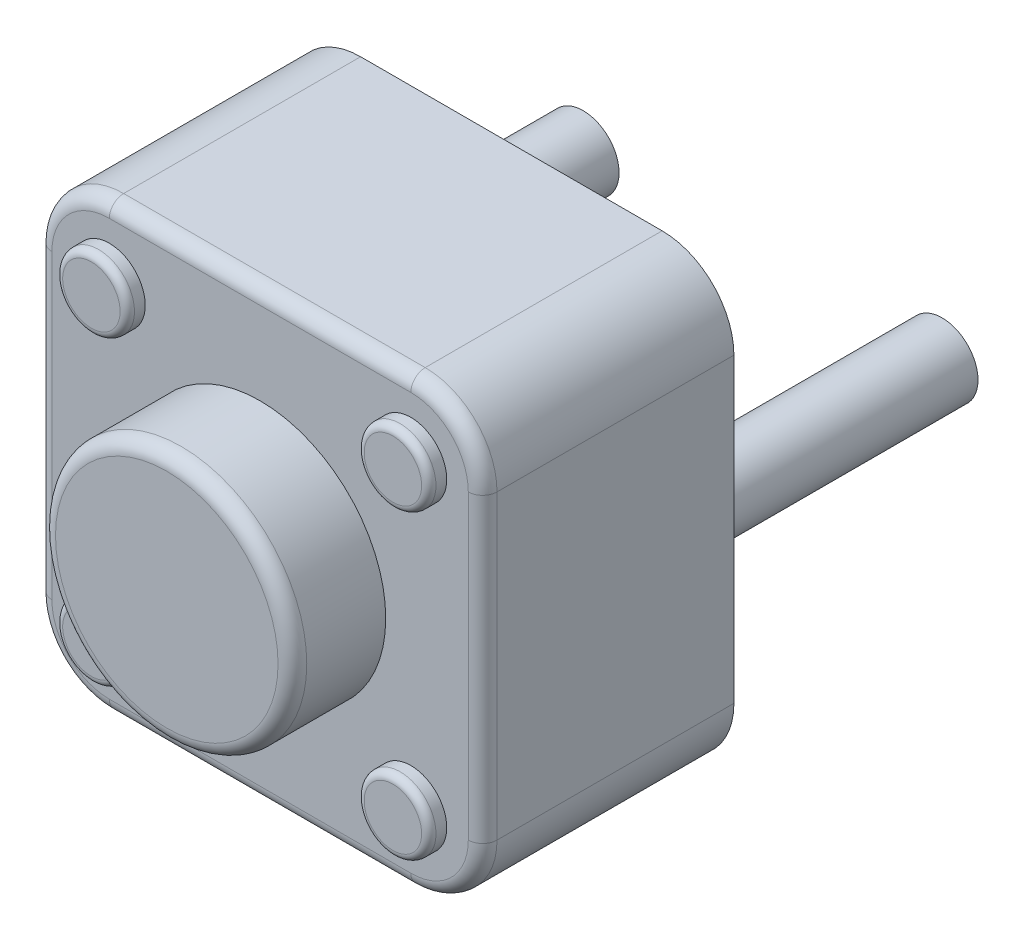
ISO-10303-21;
HEADER;
FILE_DESCRIPTION(('STEP AP214'),'2;1');
FILE_NAME('part.step','',(''),(''),'','','');
FILE_SCHEMA(('AUTOMOTIVE_DESIGN { 1 0 10303 214 1 1 1 1 }'));
ENDSEC;
DATA;
#1=APPLICATION_CONTEXT('core data for automotive mechanical design processes');
#2=APPLICATION_PROTOCOL_DEFINITION('international standard','automotive_design',2000,#1);
#3=PRODUCT_CONTEXT('',#1,'mechanical');
#4=PRODUCT('Part','Part','',(#3));
#5=PRODUCT_RELATED_PRODUCT_CATEGORY('part','',(#4));
#6=PRODUCT_DEFINITION_FORMATION('','',#4);
#7=PRODUCT_DEFINITION_CONTEXT('part definition',#1,'design');
#8=PRODUCT_DEFINITION('design','',#6,#7);
#9=PRODUCT_DEFINITION_SHAPE('','',#8);
#10=(LENGTH_UNIT() NAMED_UNIT(*) SI_UNIT(.MILLI.,.METRE.));
#11=(NAMED_UNIT(*) PLANE_ANGLE_UNIT() SI_UNIT($,.RADIAN.));
#12=(NAMED_UNIT(*) SI_UNIT($,.STERADIAN.) SOLID_ANGLE_UNIT());
#13=UNCERTAINTY_MEASURE_WITH_UNIT(LENGTH_MEASURE(1.E-05),#10,'distance_accuracy_value','');
#14=(GEOMETRIC_REPRESENTATION_CONTEXT(3) GLOBAL_UNCERTAINTY_ASSIGNED_CONTEXT((#13)) GLOBAL_UNIT_ASSIGNED_CONTEXT((#10,
#11,#12)) REPRESENTATION_CONTEXT('',''));
#15=CARTESIAN_POINT('',(0.,0.,0.));
#16=DIRECTION('',(0.,0.,1.));
#17=DIRECTION('',(1.,0.,0.));
#18=AXIS2_PLACEMENT_3D('',#15,#16,#17);
#19=CARTESIAN_POINT('',(3.1,-3.1,0.));
#20=DIRECTION('',(1.,0.,0.));
#21=DIRECTION('',(0.,0.,-1.));
#22=AXIS2_PLACEMENT_3D('',#19,#20,#21);
#23=PLANE('',#22);
#24=DIRECTION('',(0.,0.,1.));
#25=VECTOR('',#24,1.);
#26=CARTESIAN_POINT('',(3.1,2.1,0.));
#27=LINE('',#26,#25);
#28=CARTESIAN_POINT('',(3.1,2.1,0.));
#29=VERTEX_POINT('',#28);
#30=CARTESIAN_POINT('',(3.1,2.1,3.3));
#31=VERTEX_POINT('',#30);
#32=EDGE_CURVE('E165',#29,#31,#27,.T.);
#33=ORIENTED_EDGE('',*,*,#32,.T.);
#34=DIRECTION('',(0.,1.,0.));
#35=VECTOR('',#34,1.);
#36=CARTESIAN_POINT('',(3.1,-3.1,3.3));
#37=LINE('',#36,#35);
#38=CARTESIAN_POINT('',(3.1,-2.1,3.3));
#39=VERTEX_POINT('',#38);
#40=EDGE_CURVE('E226',#31,#39,#37,.F.);
#41=ORIENTED_EDGE('',*,*,#40,.T.);
#42=DIRECTION('',(0.,0.,1.));
#43=VECTOR('',#42,1.);
#44=CARTESIAN_POINT('',(3.1,-2.1,0.));
#45=LINE('',#44,#43);
#46=CARTESIAN_POINT('',(3.1,-2.1,0.));
#47=VERTEX_POINT('',#46);
#48=EDGE_CURVE('E161',#39,#47,#45,.F.);
#49=ORIENTED_EDGE('',*,*,#48,.T.);
#50=DIRECTION('',(0.,1.,0.));
#51=VECTOR('',#50,1.);
#52=CARTESIAN_POINT('',(3.1,-3.1,0.));
#53=LINE('',#52,#51);
#54=EDGE_CURVE('E274',#47,#29,#53,.T.);
#55=ORIENTED_EDGE('',*,*,#54,.T.);
#56=EDGE_LOOP('',(#33,#41,#49,#55));
#57=FACE_BOUND('',#56,.T.);
#58=ADVANCED_FACE('F38',(#57),#23,.T.);
#59=CARTESIAN_POINT('',(-3.1,-3.1,0.));
#60=DIRECTION('',(0.,-1.,0.));
#61=DIRECTION('',(0.,0.,-1.));
#62=AXIS2_PLACEMENT_3D('',#59,#60,#61);
#63=PLANE('',#62);
#64=DIRECTION('',(0.,0.,1.));
#65=VECTOR('',#64,1.);
#66=CARTESIAN_POINT('',(2.1,-3.1,0.));
#67=LINE('',#66,#65);
#68=CARTESIAN_POINT('',(2.1,-3.1,0.));
#69=VERTEX_POINT('',#68);
#70=CARTESIAN_POINT('',(2.1,-3.1,3.3));
#71=VERTEX_POINT('',#70);
#72=EDGE_CURVE('E142',#69,#71,#67,.T.);
#73=ORIENTED_EDGE('',*,*,#72,.T.);
#74=DIRECTION('',(1.,0.,0.));
#75=VECTOR('',#74,1.);
#76=CARTESIAN_POINT('',(-3.1,-3.1,3.3));
#77=LINE('',#76,#75);
#78=CARTESIAN_POINT('',(-2.1,-3.1,3.3));
#79=VERTEX_POINT('',#78);
#80=EDGE_CURVE('E139',#71,#79,#77,.F.);
#81=ORIENTED_EDGE('',*,*,#80,.T.);
#82=DIRECTION('',(0.,0.,1.));
#83=VECTOR('',#82,1.);
#84=CARTESIAN_POINT('',(-2.1,-3.1,0.));
#85=LINE('',#84,#83);
#86=CARTESIAN_POINT('',(-2.1,-3.1,0.));
#87=VERTEX_POINT('',#86);
#88=EDGE_CURVE('E132',#79,#87,#85,.F.);
#89=ORIENTED_EDGE('',*,*,#88,.T.);
#90=DIRECTION('',(1.,0.,0.));
#91=VECTOR('',#90,1.);
#92=CARTESIAN_POINT('',(-3.1,-3.1,0.));
#93=LINE('',#92,#91);
#94=EDGE_CURVE('E136',#87,#69,#93,.T.);
#95=ORIENTED_EDGE('',*,*,#94,.T.);
#96=EDGE_LOOP('',(#73,#81,#89,#95));
#97=FACE_BOUND('',#96,.T.);
#98=ADVANCED_FACE('F135',(#97),#63,.T.);
#99=CARTESIAN_POINT('',(-3.1,3.1,0.));
#100=DIRECTION('',(-1.,0.,0.));
#101=DIRECTION('',(0.,0.,1.));
#102=AXIS2_PLACEMENT_3D('',#99,#100,#101);
#103=PLANE('',#102);
#104=DIRECTION('',(0.,0.,1.));
#105=VECTOR('',#104,1.);
#106=CARTESIAN_POINT('',(-3.1,-2.1,0.));
#107=LINE('',#106,#105);
#108=CARTESIAN_POINT('',(-3.1,-2.1,0.));
#109=VERTEX_POINT('',#108);
#110=CARTESIAN_POINT('',(-3.1,-2.1,3.3));
#111=VERTEX_POINT('',#110);
#112=EDGE_CURVE('E159',#109,#111,#107,.T.);
#113=ORIENTED_EDGE('',*,*,#112,.T.);
#114=DIRECTION('',(0.,-1.,0.));
#115=VECTOR('',#114,1.);
#116=CARTESIAN_POINT('',(-3.1,3.1,3.3));
#117=LINE('',#116,#115);
#118=CARTESIAN_POINT('',(-3.1,2.1,3.3));
#119=VERTEX_POINT('',#118);
#120=EDGE_CURVE('E224',#111,#119,#117,.F.);
#121=ORIENTED_EDGE('',*,*,#120,.T.);
#122=DIRECTION('',(0.,0.,1.));
#123=VECTOR('',#122,1.);
#124=CARTESIAN_POINT('',(-3.1,2.1,0.));
#125=LINE('',#124,#123);
#126=CARTESIAN_POINT('',(-3.1,2.1,0.));
#127=VERTEX_POINT('',#126);
#128=EDGE_CURVE('E176',#119,#127,#125,.F.);
#129=ORIENTED_EDGE('',*,*,#128,.T.);
#130=DIRECTION('',(0.,-1.,0.));
#131=VECTOR('',#130,1.);
#132=CARTESIAN_POINT('',(-3.1,3.1,0.));
#133=LINE('',#132,#131);
#134=EDGE_CURVE('E154',#127,#109,#133,.T.);
#135=ORIENTED_EDGE('',*,*,#134,.T.);
#136=EDGE_LOOP('',(#113,#121,#129,#135));
#137=FACE_BOUND('',#136,.T.);
#138=ADVANCED_FACE('F325',(#137),#103,.T.);
#139=CARTESIAN_POINT('',(3.1,3.1,0.));
#140=DIRECTION('',(0.,1.,0.));
#141=DIRECTION('',(0.,0.,1.));
#142=AXIS2_PLACEMENT_3D('',#139,#140,#141);
#143=PLANE('',#142);
#144=DIRECTION('',(0.,0.,1.));
#145=VECTOR('',#144,1.);
#146=CARTESIAN_POINT('',(-2.1,3.1,0.));
#147=LINE('',#146,#145);
#148=CARTESIAN_POINT('',(-2.1,3.1,0.));
#149=VERTEX_POINT('',#148);
#150=CARTESIAN_POINT('',(-2.1,3.1,3.3));
#151=VERTEX_POINT('',#150);
#152=EDGE_CURVE('E171',#149,#151,#147,.T.);
#153=ORIENTED_EDGE('',*,*,#152,.T.);
#154=DIRECTION('',(-1.,0.,0.));
#155=VECTOR('',#154,1.);
#156=CARTESIAN_POINT('',(3.1,3.1,3.3));
#157=LINE('',#156,#155);
#158=CARTESIAN_POINT('',(2.1,3.1,3.3));
#159=VERTEX_POINT('',#158);
#160=EDGE_CURVE('E55',#151,#159,#157,.F.);
#161=ORIENTED_EDGE('',*,*,#160,.T.);
#162=DIRECTION('',(0.,0.,1.));
#163=VECTOR('',#162,1.);
#164=CARTESIAN_POINT('',(2.1,3.1,0.));
#165=LINE('',#164,#163);
#166=CARTESIAN_POINT('',(2.1,3.1,0.));
#167=VERTEX_POINT('',#166);
#168=EDGE_CURVE('E173',#159,#167,#165,.F.);
#169=ORIENTED_EDGE('',*,*,#168,.T.);
#170=DIRECTION('',(-1.,0.,0.));
#171=VECTOR('',#170,1.);
#172=CARTESIAN_POINT('',(3.1,3.1,0.));
#173=LINE('',#172,#171);
#174=EDGE_CURVE('E277',#167,#149,#173,.T.);
#175=ORIENTED_EDGE('',*,*,#174,.T.);
#176=EDGE_LOOP('',(#153,#161,#169,#175));
#177=FACE_BOUND('',#176,.T.);
#178=ADVANCED_FACE('F355',(#177),#143,.T.);
#179=CARTESIAN_POINT('',(0.,0.,0.));
#180=DIRECTION('',(0.,0.,1.));
#181=DIRECTION('',(1.,0.,0.));
#182=AXIS2_PLACEMENT_3D('',#179,#180,#181);
#183=PLANE('',#182);
#184=CARTESIAN_POINT('',(-2.5,0.,0.));
#185=DIRECTION('',(0.,0.,1.));
#186=DIRECTION('',(1.,0.,0.));
#187=AXIS2_PLACEMENT_3D('',#184,#185,#186);
#188=CIRCLE('',#187,0.5);
#189=CARTESIAN_POINT('',(-2.,0.,0.));
#190=VERTEX_POINT('',#189);
#191=EDGE_CURVE('E256',#190,#190,#188,.T.);
#192=ORIENTED_EDGE('',*,*,#191,.T.);
#193=EDGE_LOOP('',(#192));
#194=FACE_BOUND('',#193,.T.);
#195=CARTESIAN_POINT('',(2.5,0.,0.));
#196=DIRECTION('',(0.,0.,1.));
#197=DIRECTION('',(1.,0.,0.));
#198=AXIS2_PLACEMENT_3D('',#195,#196,#197);
#199=CIRCLE('',#198,0.5);
#200=CARTESIAN_POINT('',(3.,0.,0.));
#201=VERTEX_POINT('',#200);
#202=EDGE_CURVE('E266',#201,#201,#199,.T.);
#203=ORIENTED_EDGE('',*,*,#202,.T.);
#204=EDGE_LOOP('',(#203));
#205=FACE_BOUND('',#204,.T.);
#206=ORIENTED_EDGE('',*,*,#54,.F.);
#207=CARTESIAN_POINT('',(2.1,-2.1,0.));
#208=DIRECTION('',(0.,0.,1.));
#209=DIRECTION('',(1.,0.,0.));
#210=AXIS2_PLACEMENT_3D('',#207,#208,#209);
#211=CIRCLE('',#210,1.);
#212=EDGE_CURVE('E152',#47,#69,#211,.F.);
#213=ORIENTED_EDGE('',*,*,#212,.T.);
#214=ORIENTED_EDGE('',*,*,#94,.F.);
#215=CARTESIAN_POINT('',(-2.1,-2.1,0.));
#216=DIRECTION('',(0.,0.,1.));
#217=DIRECTION('',(1.,0.,0.));
#218=AXIS2_PLACEMENT_3D('',#215,#216,#217);
#219=CIRCLE('',#218,1.);
#220=EDGE_CURVE('E149',#87,#109,#219,.F.);
#221=ORIENTED_EDGE('',*,*,#220,.T.);
#222=ORIENTED_EDGE('',*,*,#134,.F.);
#223=CARTESIAN_POINT('',(-2.1,2.1,0.));
#224=DIRECTION('',(0.,0.,1.));
#225=DIRECTION('',(1.,0.,0.));
#226=AXIS2_PLACEMENT_3D('',#223,#224,#225);
#227=CIRCLE('',#226,1.);
#228=EDGE_CURVE('E160',#127,#149,#227,.F.);
#229=ORIENTED_EDGE('',*,*,#228,.T.);
#230=ORIENTED_EDGE('',*,*,#174,.F.);
#231=CARTESIAN_POINT('',(2.1,2.1,0.));
#232=DIRECTION('',(0.,0.,1.));
#233=DIRECTION('',(1.,0.,0.));
#234=AXIS2_PLACEMENT_3D('',#231,#232,#233);
#235=CIRCLE('',#234,1.);
#236=EDGE_CURVE('E163',#167,#29,#235,.F.);
#237=ORIENTED_EDGE('',*,*,#236,.T.);
#238=EDGE_LOOP('',(#206,#213,#214,#221,#222,#229,#230,#237));
#239=FACE_BOUND('',#238,.T.);
#240=ADVANCED_FACE('F147',(#194,#205,#239),#183,.F.);
#241=CARTESIAN_POINT('',(0.,0.,3.5));
#242=DIRECTION('',(0.,0.,1.));
#243=DIRECTION('',(1.,0.,0.));
#244=AXIS2_PLACEMENT_3D('',#241,#242,#243);
#245=PLANE('',#244);
#246=CARTESIAN_POINT('',(-2.1,-2.1,3.5));
#247=DIRECTION('',(0.,0.,1.));
#248=DIRECTION('',(1.,0.,0.));
#249=AXIS2_PLACEMENT_3D('',#246,#247,#248);
#250=CIRCLE('',#249,0.8);
#251=CARTESIAN_POINT('',(-2.9,-2.1,3.5));
#252=VERTEX_POINT('',#251);
#253=CARTESIAN_POINT('',(-2.1,-2.9,3.5));
#254=VERTEX_POINT('',#253);
#255=EDGE_CURVE('E214',#252,#254,#250,.T.);
#256=ORIENTED_EDGE('',*,*,#255,.T.);
#257=DIRECTION('',(1.,0.,0.));
#258=VECTOR('',#257,1.);
#259=CARTESIAN_POINT('',(0.,-2.9,3.5));
#260=LINE('',#259,#258);
#261=CARTESIAN_POINT('',(2.1,-2.9,3.5));
#262=VERTEX_POINT('',#261);
#263=EDGE_CURVE('E216',#254,#262,#260,.T.);
#264=ORIENTED_EDGE('',*,*,#263,.T.);
#265=CARTESIAN_POINT('',(2.1,-2.1,3.5));
#266=DIRECTION('',(0.,0.,1.));
#267=DIRECTION('',(1.,0.,0.));
#268=AXIS2_PLACEMENT_3D('',#265,#266,#267);
#269=CIRCLE('',#268,0.8);
#270=CARTESIAN_POINT('',(2.9,-2.1,3.5));
#271=VERTEX_POINT('',#270);
#272=EDGE_CURVE('E212',#262,#271,#269,.T.);
#273=ORIENTED_EDGE('',*,*,#272,.T.);
#274=DIRECTION('',(0.,1.,0.));
#275=VECTOR('',#274,1.);
#276=CARTESIAN_POINT('',(2.9,0.,3.5));
#277=LINE('',#276,#275);
#278=CARTESIAN_POINT('',(2.9,2.1,3.5));
#279=VERTEX_POINT('',#278);
#280=EDGE_CURVE('E208',#271,#279,#277,.T.);
#281=ORIENTED_EDGE('',*,*,#280,.T.);
#282=CARTESIAN_POINT('',(2.1,2.1,3.5));
#283=DIRECTION('',(0.,0.,1.));
#284=DIRECTION('',(1.,0.,0.));
#285=AXIS2_PLACEMENT_3D('',#282,#283,#284);
#286=CIRCLE('',#285,0.8);
#287=CARTESIAN_POINT('',(2.1,2.9,3.5));
#288=VERTEX_POINT('',#287);
#289=EDGE_CURVE('E204',#279,#288,#286,.T.);
#290=ORIENTED_EDGE('',*,*,#289,.T.);
#291=DIRECTION('',(-1.,0.,0.));
#292=VECTOR('',#291,1.);
#293=CARTESIAN_POINT('',(0.,2.9,3.5));
#294=LINE('',#293,#292);
#295=CARTESIAN_POINT('',(-2.1,2.9,3.5));
#296=VERTEX_POINT('',#295);
#297=EDGE_CURVE('E202',#288,#296,#294,.T.);
#298=ORIENTED_EDGE('',*,*,#297,.T.);
#299=CARTESIAN_POINT('',(-2.1,2.1,3.5));
#300=DIRECTION('',(0.,0.,1.));
#301=DIRECTION('',(1.,0.,0.));
#302=AXIS2_PLACEMENT_3D('',#299,#300,#301);
#303=CIRCLE('',#302,0.8);
#304=CARTESIAN_POINT('',(-2.9,2.1,3.5));
#305=VERTEX_POINT('',#304);
#306=EDGE_CURVE('E206',#296,#305,#303,.T.);
#307=ORIENTED_EDGE('',*,*,#306,.T.);
#308=DIRECTION('',(0.,-1.,0.));
#309=VECTOR('',#308,1.);
#310=CARTESIAN_POINT('',(-2.9,0.,3.5));
#311=LINE('',#310,#309);
#312=EDGE_CURVE('E210',#305,#252,#311,.T.);
#313=ORIENTED_EDGE('',*,*,#312,.T.);
#314=EDGE_LOOP('',(#256,#264,#273,#281,#290,#298,#307,#313));
#315=FACE_BOUND('',#314,.T.);
#316=CARTESIAN_POINT('',(-2.1,-2.1,3.5));
#317=DIRECTION('',(0.,0.,1.));
#318=DIRECTION('',(1.,0.,0.));
#319=AXIS2_PLACEMENT_3D('',#316,#317,#318);
#320=CIRCLE('',#319,0.5);
#321=CARTESIAN_POINT('',(-1.6,-2.1,3.5));
#322=VERTEX_POINT('',#321);
#323=EDGE_CURVE('E143',#322,#322,#320,.T.);
#324=ORIENTED_EDGE('',*,*,#323,.F.);
#325=EDGE_LOOP('',(#324));
#326=FACE_BOUND('',#325,.T.);
#327=CARTESIAN_POINT('',(0.,0.,3.5));
#328=DIRECTION('',(0.,0.,1.));
#329=DIRECTION('',(1.,0.,0.));
#330=AXIS2_PLACEMENT_3D('',#327,#328,#329);
#331=CIRCLE('',#330,1.75);
#332=CARTESIAN_POINT('',(1.75,0.,3.5));
#333=VERTEX_POINT('',#332);
#334=EDGE_CURVE('E289',#333,#333,#331,.T.);
#335=ORIENTED_EDGE('',*,*,#334,.F.);
#336=EDGE_LOOP('',(#335));
#337=FACE_BOUND('',#336,.T.);
#338=CARTESIAN_POINT('',(-2.1,2.1,3.5));
#339=DIRECTION('',(0.,0.,1.));
#340=DIRECTION('',(1.,0.,0.));
#341=AXIS2_PLACEMENT_3D('',#338,#339,#340);
#342=CIRCLE('',#341,0.5);
#343=CARTESIAN_POINT('',(-1.6,2.1,3.5));
#344=VERTEX_POINT('',#343);
#345=EDGE_CURVE('E286',#344,#344,#342,.T.);
#346=ORIENTED_EDGE('',*,*,#345,.F.);
#347=EDGE_LOOP('',(#346));
#348=FACE_BOUND('',#347,.T.);
#349=CARTESIAN_POINT('',(2.1,2.1,3.5));
#350=DIRECTION('',(0.,0.,1.));
#351=DIRECTION('',(1.,0.,0.));
#352=AXIS2_PLACEMENT_3D('',#349,#350,#351);
#353=CIRCLE('',#352,0.5);
#354=CARTESIAN_POINT('',(2.6,2.1,3.5));
#355=VERTEX_POINT('',#354);
#356=EDGE_CURVE('E283',#355,#355,#353,.T.);
#357=ORIENTED_EDGE('',*,*,#356,.F.);
#358=EDGE_LOOP('',(#357));
#359=FACE_BOUND('',#358,.T.);
#360=CARTESIAN_POINT('',(2.1,-2.1,3.5));
#361=DIRECTION('',(0.,0.,1.));
#362=DIRECTION('',(1.,0.,0.));
#363=AXIS2_PLACEMENT_3D('',#360,#361,#362);
#364=CIRCLE('',#363,0.5);
#365=CARTESIAN_POINT('',(2.6,-2.1,3.5));
#366=VERTEX_POINT('',#365);
#367=EDGE_CURVE('E153',#366,#366,#364,.T.);
#368=ORIENTED_EDGE('',*,*,#367,.F.);
#369=EDGE_LOOP('',(#368));
#370=FACE_BOUND('',#369,.T.);
#371=ADVANCED_FACE('F332',(#315,#326,#337,#348,#359,#370),#245,.T.);
#372=CARTESIAN_POINT('',(2.5,0.,-3.5));
#373=DIRECTION('',(0.,0.,1.));
#374=DIRECTION('',(1.,0.,0.));
#375=AXIS2_PLACEMENT_3D('',#372,#373,#374);
#376=CYLINDRICAL_SURFACE('',#375,0.5);
#377=CARTESIAN_POINT('',(2.5,0.,-3.5));
#378=DIRECTION('',(0.,0.,1.));
#379=DIRECTION('',(1.,0.,0.));
#380=AXIS2_PLACEMENT_3D('',#377,#378,#379);
#381=CIRCLE('',#380,0.5);
#382=CARTESIAN_POINT('',(3.,0.,-3.5));
#383=VERTEX_POINT('',#382);
#384=EDGE_CURVE('E271',#383,#383,#381,.T.);
#385=ORIENTED_EDGE('',*,*,#384,.T.);
#386=EDGE_LOOP('',(#385));
#387=FACE_BOUND('',#386,.T.);
#388=ORIENTED_EDGE('',*,*,#202,.F.);
#389=EDGE_LOOP('',(#388));
#390=FACE_BOUND('',#389,.T.);
#391=ADVANCED_FACE('F446',(#387,#390),#376,.T.);
#392=CARTESIAN_POINT('',(3.,0.,-3.5));
#393=DIRECTION('',(0.,0.,-1.));
#394=DIRECTION('',(-1.,0.,0.));
#395=AXIS2_PLACEMENT_3D('',#392,#393,#394);
#396=PLANE('',#395);
#397=ORIENTED_EDGE('',*,*,#384,.F.);
#398=EDGE_LOOP('',(#397));
#399=FACE_BOUND('',#398,.T.);
#400=ADVANCED_FACE('F455',(#399),#396,.T.);
#401=CARTESIAN_POINT('',(-2.5,0.,-3.5));
#402=DIRECTION('',(0.,0.,1.));
#403=DIRECTION('',(1.,0.,0.));
#404=AXIS2_PLACEMENT_3D('',#401,#402,#403);
#405=CYLINDRICAL_SURFACE('',#404,0.5);
#406=CARTESIAN_POINT('',(-2.5,0.,-3.5));
#407=DIRECTION('',(0.,0.,1.));
#408=DIRECTION('',(1.,0.,0.));
#409=AXIS2_PLACEMENT_3D('',#406,#407,#408);
#410=CIRCLE('',#409,0.5);
#411=CARTESIAN_POINT('',(-2.,0.,-3.5));
#412=VERTEX_POINT('',#411);
#413=EDGE_CURVE('E261',#412,#412,#410,.T.);
#414=ORIENTED_EDGE('',*,*,#413,.T.);
#415=EDGE_LOOP('',(#414));
#416=FACE_BOUND('',#415,.T.);
#417=ORIENTED_EDGE('',*,*,#191,.F.);
#418=EDGE_LOOP('',(#417));
#419=FACE_BOUND('',#418,.T.);
#420=ADVANCED_FACE('F463',(#416,#419),#405,.T.);
#421=CARTESIAN_POINT('',(-2.,0.,-3.5));
#422=DIRECTION('',(0.,0.,-1.));
#423=DIRECTION('',(-1.,0.,0.));
#424=AXIS2_PLACEMENT_3D('',#421,#422,#423);
#425=PLANE('',#424);
#426=ORIENTED_EDGE('',*,*,#413,.F.);
#427=EDGE_LOOP('',(#426));
#428=FACE_BOUND('',#427,.T.);
#429=ADVANCED_FACE('F471',(#428),#425,.T.);
#430=CARTESIAN_POINT('',(2.1,-2.1,3.75));
#431=DIRECTION('',(0.,0.,-1.));
#432=DIRECTION('',(-1.,0.,0.));
#433=AXIS2_PLACEMENT_3D('',#430,#431,#432);
#434=CYLINDRICAL_SURFACE('',#433,0.5);
#435=CARTESIAN_POINT('',(2.1,-2.1,3.65));
#436=DIRECTION('',(0.,0.,1.));
#437=DIRECTION('',(1.,0.,0.));
#438=AXIS2_PLACEMENT_3D('',#435,#436,#437);
#439=CIRCLE('',#438,0.5);
#440=CARTESIAN_POINT('',(2.6,-2.1,3.65));
#441=VERTEX_POINT('',#440);
#442=EDGE_CURVE('E196',#441,#441,#439,.F.);
#443=ORIENTED_EDGE('',*,*,#442,.T.);
#444=EDGE_LOOP('',(#443));
#445=FACE_BOUND('',#444,.T.);
#446=ORIENTED_EDGE('',*,*,#367,.T.);
#447=EDGE_LOOP('',(#446));
#448=FACE_BOUND('',#447,.T.);
#449=ADVANCED_FACE('F478',(#445,#448),#434,.T.);
#450=CARTESIAN_POINT('',(2.6,-2.1,3.75));
#451=DIRECTION('',(0.,0.,1.));
#452=DIRECTION('',(1.,0.,0.));
#453=AXIS2_PLACEMENT_3D('',#450,#451,#452);
#454=PLANE('',#453);
#455=CARTESIAN_POINT('',(2.1,-2.1,3.75));
#456=DIRECTION('',(0.,0.,1.));
#457=DIRECTION('',(1.,0.,0.));
#458=AXIS2_PLACEMENT_3D('',#455,#456,#457);
#459=CIRCLE('',#458,0.4);
#460=CARTESIAN_POINT('',(2.5,-2.1,3.75));
#461=VERTEX_POINT('',#460);
#462=EDGE_CURVE('E199',#461,#461,#459,.T.);
#463=ORIENTED_EDGE('',*,*,#462,.T.);
#464=EDGE_LOOP('',(#463));
#465=FACE_BOUND('',#464,.T.);
#466=ADVANCED_FACE('F485',(#465),#454,.T.);
#467=CARTESIAN_POINT('',(2.1,2.1,3.75));
#468=DIRECTION('',(0.,0.,-1.));
#469=DIRECTION('',(-1.,0.,0.));
#470=AXIS2_PLACEMENT_3D('',#467,#468,#469);
#471=CYLINDRICAL_SURFACE('',#470,0.5);
#472=CARTESIAN_POINT('',(2.1,2.1,3.65));
#473=DIRECTION('',(0.,0.,1.));
#474=DIRECTION('',(1.,0.,0.));
#475=AXIS2_PLACEMENT_3D('',#472,#473,#474);
#476=CIRCLE('',#475,0.5);
#477=CARTESIAN_POINT('',(2.6,2.1,3.65));
#478=VERTEX_POINT('',#477);
#479=EDGE_CURVE('E184',#478,#478,#476,.F.);
#480=ORIENTED_EDGE('',*,*,#479,.T.);
#481=EDGE_LOOP('',(#480));
#482=FACE_BOUND('',#481,.T.);
#483=ORIENTED_EDGE('',*,*,#356,.T.);
#484=EDGE_LOOP('',(#483));
#485=FACE_BOUND('',#484,.T.);
#486=ADVANCED_FACE('F493',(#482,#485),#471,.T.);
#487=CARTESIAN_POINT('',(2.6,2.1,3.75));
#488=DIRECTION('',(0.,0.,1.));
#489=DIRECTION('',(1.,0.,0.));
#490=AXIS2_PLACEMENT_3D('',#487,#488,#489);
#491=PLANE('',#490);
#492=CARTESIAN_POINT('',(2.1,2.1,3.75));
#493=DIRECTION('',(0.,0.,1.));
#494=DIRECTION('',(1.,0.,0.));
#495=AXIS2_PLACEMENT_3D('',#492,#493,#494);
#496=CIRCLE('',#495,0.4);
#497=CARTESIAN_POINT('',(2.5,2.1,3.75));
#498=VERTEX_POINT('',#497);
#499=EDGE_CURVE('E187',#498,#498,#496,.T.);
#500=ORIENTED_EDGE('',*,*,#499,.T.);
#501=EDGE_LOOP('',(#500));
#502=FACE_BOUND('',#501,.T.);
#503=ADVANCED_FACE('F501',(#502),#491,.T.);
#504=CARTESIAN_POINT('',(-2.1,2.1,3.75));
#505=DIRECTION('',(0.,0.,-1.));
#506=DIRECTION('',(-1.,0.,0.));
#507=AXIS2_PLACEMENT_3D('',#504,#505,#506);
#508=CYLINDRICAL_SURFACE('',#507,0.5);
#509=CARTESIAN_POINT('',(-2.1,2.1,3.65));
#510=DIRECTION('',(0.,0.,1.));
#511=DIRECTION('',(1.,0.,0.));
#512=AXIS2_PLACEMENT_3D('',#509,#510,#511);
#513=CIRCLE('',#512,0.5);
#514=CARTESIAN_POINT('',(-1.6,2.1,3.65));
#515=VERTEX_POINT('',#514);
#516=EDGE_CURVE('E190',#515,#515,#513,.F.);
#517=ORIENTED_EDGE('',*,*,#516,.T.);
#518=EDGE_LOOP('',(#517));
#519=FACE_BOUND('',#518,.T.);
#520=ORIENTED_EDGE('',*,*,#345,.T.);
#521=EDGE_LOOP('',(#520));
#522=FACE_BOUND('',#521,.T.);
#523=ADVANCED_FACE('F509',(#519,#522),#508,.T.);
#524=CARTESIAN_POINT('',(-1.6,2.1,3.75));
#525=DIRECTION('',(0.,0.,1.));
#526=DIRECTION('',(1.,0.,0.));
#527=AXIS2_PLACEMENT_3D('',#524,#525,#526);
#528=PLANE('',#527);
#529=CARTESIAN_POINT('',(-2.1,2.1,3.75));
#530=DIRECTION('',(0.,0.,1.));
#531=DIRECTION('',(1.,0.,0.));
#532=AXIS2_PLACEMENT_3D('',#529,#530,#531);
#533=CIRCLE('',#532,0.4);
#534=CARTESIAN_POINT('',(-1.7,2.1,3.75));
#535=VERTEX_POINT('',#534);
#536=EDGE_CURVE('E193',#535,#535,#533,.T.);
#537=ORIENTED_EDGE('',*,*,#536,.T.);
#538=EDGE_LOOP('',(#537));
#539=FACE_BOUND('',#538,.T.);
#540=ADVANCED_FACE('F517',(#539),#528,.T.);
#541=CARTESIAN_POINT('',(0.,0.,4.8));
#542=DIRECTION('',(0.,0.,-1.));
#543=DIRECTION('',(-1.,0.,0.));
#544=AXIS2_PLACEMENT_3D('',#541,#542,#543);
#545=CYLINDRICAL_SURFACE('',#544,1.75);
#546=CARTESIAN_POINT('',(0.,0.,4.6));
#547=DIRECTION('',(0.,0.,1.));
#548=DIRECTION('',(1.,0.,0.));
#549=AXIS2_PLACEMENT_3D('',#546,#547,#548);
#550=CIRCLE('',#549,1.75);
#551=CARTESIAN_POINT('',(1.75,0.,4.6));
#552=VERTEX_POINT('',#551);
#553=EDGE_CURVE('E47',#552,#552,#550,.F.);
#554=ORIENTED_EDGE('',*,*,#553,.T.);
#555=EDGE_LOOP('',(#554));
#556=FACE_BOUND('',#555,.T.);
#557=ORIENTED_EDGE('',*,*,#334,.T.);
#558=EDGE_LOOP('',(#557));
#559=FACE_BOUND('',#558,.T.);
#560=ADVANCED_FACE('F525',(#556,#559),#545,.T.);
#561=CARTESIAN_POINT('',(1.75,0.,4.8));
#562=DIRECTION('',(0.,0.,1.));
#563=DIRECTION('',(1.,0.,0.));
#564=AXIS2_PLACEMENT_3D('',#561,#562,#563);
#565=PLANE('',#564);
#566=CARTESIAN_POINT('',(0.,0.,4.8));
#567=DIRECTION('',(0.,0.,1.));
#568=DIRECTION('',(1.,0.,0.));
#569=AXIS2_PLACEMENT_3D('',#566,#567,#568);
#570=CIRCLE('',#569,1.55);
#571=CARTESIAN_POINT('',(1.55,0.,4.8));
#572=VERTEX_POINT('',#571);
#573=EDGE_CURVE('E11',#572,#572,#570,.T.);
#574=ORIENTED_EDGE('',*,*,#573,.T.);
#575=EDGE_LOOP('',(#574));
#576=FACE_BOUND('',#575,.T.);
#577=ADVANCED_FACE('F533',(#576),#565,.T.);
#578=CARTESIAN_POINT('',(-2.1,-2.1,3.75));
#579=DIRECTION('',(0.,0.,-1.));
#580=DIRECTION('',(-1.,0.,0.));
#581=AXIS2_PLACEMENT_3D('',#578,#579,#580);
#582=CYLINDRICAL_SURFACE('',#581,0.5);
#583=CARTESIAN_POINT('',(-2.1,-2.1,3.65));
#584=DIRECTION('',(0.,0.,1.));
#585=DIRECTION('',(1.,0.,0.));
#586=AXIS2_PLACEMENT_3D('',#583,#584,#585);
#587=CIRCLE('',#586,0.5);
#588=CARTESIAN_POINT('',(-1.6,-2.1,3.65));
#589=VERTEX_POINT('',#588);
#590=EDGE_CURVE('E178',#589,#589,#587,.F.);
#591=ORIENTED_EDGE('',*,*,#590,.T.);
#592=EDGE_LOOP('',(#591));
#593=FACE_BOUND('',#592,.T.);
#594=ORIENTED_EDGE('',*,*,#323,.T.);
#595=EDGE_LOOP('',(#594));
#596=FACE_BOUND('',#595,.T.);
#597=ADVANCED_FACE('F541',(#593,#596),#582,.T.);
#598=CARTESIAN_POINT('',(-1.6,-2.1,3.75));
#599=DIRECTION('',(0.,0.,1.));
#600=DIRECTION('',(1.,0.,0.));
#601=AXIS2_PLACEMENT_3D('',#598,#599,#600);
#602=PLANE('',#601);
#603=CARTESIAN_POINT('',(-2.1,-2.1,3.75));
#604=DIRECTION('',(0.,0.,1.));
#605=DIRECTION('',(1.,0.,0.));
#606=AXIS2_PLACEMENT_3D('',#603,#604,#605);
#607=CIRCLE('',#606,0.4);
#608=CARTESIAN_POINT('',(-1.7,-2.1,3.75));
#609=VERTEX_POINT('',#608);
#610=EDGE_CURVE('E181',#609,#609,#607,.T.);
#611=ORIENTED_EDGE('',*,*,#610,.T.);
#612=EDGE_LOOP('',(#611));
#613=FACE_BOUND('',#612,.T.);
#614=ADVANCED_FACE('F360',(#613),#602,.T.);
#615=CARTESIAN_POINT('',(2.1,-2.1,0.));
#616=DIRECTION('',(0.,0.,1.));
#617=DIRECTION('',(1.,0.,0.));
#618=AXIS2_PLACEMENT_3D('',#615,#616,#617);
#619=CYLINDRICAL_SURFACE('',#618,1.);
#620=ORIENTED_EDGE('',*,*,#48,.F.);
#621=CARTESIAN_POINT('',(2.1,-2.1,3.3));
#622=DIRECTION('',(0.,0.,1.));
#623=DIRECTION('',(1.,0.,0.));
#624=AXIS2_PLACEMENT_3D('',#621,#622,#623);
#625=CIRCLE('',#624,1.);
#626=EDGE_CURVE('E222',#39,#71,#625,.F.);
#627=ORIENTED_EDGE('',*,*,#626,.T.);
#628=ORIENTED_EDGE('',*,*,#72,.F.);
#629=ORIENTED_EDGE('',*,*,#212,.F.);
#630=EDGE_LOOP('',(#620,#627,#628,#629));
#631=FACE_BOUND('',#630,.T.);
#632=ADVANCED_FACE('F313',(#631),#619,.T.);
#633=CARTESIAN_POINT('',(2.1,2.1,0.));
#634=DIRECTION('',(0.,0.,1.));
#635=DIRECTION('',(1.,0.,0.));
#636=AXIS2_PLACEMENT_3D('',#633,#634,#635);
#637=CYLINDRICAL_SURFACE('',#636,1.);
#638=ORIENTED_EDGE('',*,*,#168,.F.);
#639=CARTESIAN_POINT('',(2.1,2.1,3.3));
#640=DIRECTION('',(0.,0.,1.));
#641=DIRECTION('',(1.,0.,0.));
#642=AXIS2_PLACEMENT_3D('',#639,#640,#641);
#643=CIRCLE('',#642,1.);
#644=EDGE_CURVE('E229',#159,#31,#643,.F.);
#645=ORIENTED_EDGE('',*,*,#644,.T.);
#646=ORIENTED_EDGE('',*,*,#32,.F.);
#647=ORIENTED_EDGE('',*,*,#236,.F.);
#648=EDGE_LOOP('',(#638,#645,#646,#647));
#649=FACE_BOUND('',#648,.T.);
#650=ADVANCED_FACE('F359',(#649),#637,.T.);
#651=CARTESIAN_POINT('',(-2.1,2.1,0.));
#652=DIRECTION('',(0.,0.,1.));
#653=DIRECTION('',(1.,0.,0.));
#654=AXIS2_PLACEMENT_3D('',#651,#652,#653);
#655=CYLINDRICAL_SURFACE('',#654,1.);
#656=ORIENTED_EDGE('',*,*,#128,.F.);
#657=CARTESIAN_POINT('',(-2.1,2.1,3.3));
#658=DIRECTION('',(0.,0.,1.));
#659=DIRECTION('',(1.,0.,0.));
#660=AXIS2_PLACEMENT_3D('',#657,#658,#659);
#661=CIRCLE('',#660,1.);
#662=EDGE_CURVE('E63',#119,#151,#661,.F.);
#663=ORIENTED_EDGE('',*,*,#662,.T.);
#664=ORIENTED_EDGE('',*,*,#152,.F.);
#665=ORIENTED_EDGE('',*,*,#228,.F.);
#666=EDGE_LOOP('',(#656,#663,#664,#665));
#667=FACE_BOUND('',#666,.T.);
#668=ADVANCED_FACE('F363',(#667),#655,.T.);
#669=CARTESIAN_POINT('',(-2.1,-2.1,0.));
#670=DIRECTION('',(0.,0.,1.));
#671=DIRECTION('',(1.,0.,0.));
#672=AXIS2_PLACEMENT_3D('',#669,#670,#671);
#673=CYLINDRICAL_SURFACE('',#672,1.);
#674=ORIENTED_EDGE('',*,*,#88,.F.);
#675=CARTESIAN_POINT('',(-2.1,-2.1,3.3));
#676=DIRECTION('',(0.,0.,1.));
#677=DIRECTION('',(1.,0.,0.));
#678=AXIS2_PLACEMENT_3D('',#675,#676,#677);
#679=CIRCLE('',#678,1.);
#680=EDGE_CURVE('E220',#79,#111,#679,.F.);
#681=ORIENTED_EDGE('',*,*,#680,.T.);
#682=ORIENTED_EDGE('',*,*,#112,.F.);
#683=ORIENTED_EDGE('',*,*,#220,.F.);
#684=EDGE_LOOP('',(#674,#681,#682,#683));
#685=FACE_BOUND('',#684,.T.);
#686=ADVANCED_FACE('F157',(#685),#673,.T.);
#687=CARTESIAN_POINT('',(-2.1,-2.1,3.65));
#688=DIRECTION('',(0.,0.,1.));
#689=DIRECTION('',(1.,0.,0.));
#690=AXIS2_PLACEMENT_3D('',#687,#688,#689);
#691=TOROIDAL_SURFACE('',#690,0.4,0.1);
#692=ORIENTED_EDGE('',*,*,#610,.F.);
#693=EDGE_LOOP('',(#692));
#694=FACE_BOUND('',#693,.T.);
#695=ORIENTED_EDGE('',*,*,#590,.F.);
#696=EDGE_LOOP('',(#695));
#697=FACE_BOUND('',#696,.T.);
#698=ADVANCED_FACE('F368',(#694,#697),#691,.T.);
#699=CARTESIAN_POINT('',(2.1,2.1,3.65));
#700=DIRECTION('',(0.,0.,1.));
#701=DIRECTION('',(1.,0.,0.));
#702=AXIS2_PLACEMENT_3D('',#699,#700,#701);
#703=TOROIDAL_SURFACE('',#702,0.4,0.1);
#704=ORIENTED_EDGE('',*,*,#499,.F.);
#705=EDGE_LOOP('',(#704));
#706=FACE_BOUND('',#705,.T.);
#707=ORIENTED_EDGE('',*,*,#479,.F.);
#708=EDGE_LOOP('',(#707));
#709=FACE_BOUND('',#708,.T.);
#710=ADVANCED_FACE('F371',(#706,#709),#703,.T.);
#711=CARTESIAN_POINT('',(-2.1,2.1,3.65));
#712=DIRECTION('',(0.,0.,1.));
#713=DIRECTION('',(1.,0.,0.));
#714=AXIS2_PLACEMENT_3D('',#711,#712,#713);
#715=TOROIDAL_SURFACE('',#714,0.4,0.1);
#716=ORIENTED_EDGE('',*,*,#536,.F.);
#717=EDGE_LOOP('',(#716));
#718=FACE_BOUND('',#717,.T.);
#719=ORIENTED_EDGE('',*,*,#516,.F.);
#720=EDGE_LOOP('',(#719));
#721=FACE_BOUND('',#720,.T.);
#722=ADVANCED_FACE('F344',(#718,#721),#715,.T.);
#723=CARTESIAN_POINT('',(2.1,-2.1,3.65));
#724=DIRECTION('',(0.,0.,1.));
#725=DIRECTION('',(1.,0.,0.));
#726=AXIS2_PLACEMENT_3D('',#723,#724,#725);
#727=TOROIDAL_SURFACE('',#726,0.4,0.1);
#728=ORIENTED_EDGE('',*,*,#462,.F.);
#729=EDGE_LOOP('',(#728));
#730=FACE_BOUND('',#729,.T.);
#731=ORIENTED_EDGE('',*,*,#442,.F.);
#732=EDGE_LOOP('',(#731));
#733=FACE_BOUND('',#732,.T.);
#734=ADVANCED_FACE('F338',(#730,#733),#727,.T.);
#735=CARTESIAN_POINT('',(0.,2.9,3.3));
#736=DIRECTION('',(-1.,0.,0.));
#737=DIRECTION('',(0.,0.,1.));
#738=AXIS2_PLACEMENT_3D('',#735,#736,#737);
#739=CYLINDRICAL_SURFACE('',#738,0.2);
#740=CARTESIAN_POINT('',(2.1,2.9,3.3));
#741=DIRECTION('',(1.,0.,0.));
#742=DIRECTION('',(0.,0.,-1.));
#743=AXIS2_PLACEMENT_3D('',#740,#741,#742);
#744=CIRCLE('',#743,0.2);
#745=EDGE_CURVE('E249',#159,#288,#744,.T.);
#746=ORIENTED_EDGE('',*,*,#745,.F.);
#747=ORIENTED_EDGE('',*,*,#160,.F.);
#748=CARTESIAN_POINT('',(-2.1,2.9,3.3));
#749=DIRECTION('',(-1.,0.,0.));
#750=DIRECTION('',(0.,0.,1.));
#751=AXIS2_PLACEMENT_3D('',#748,#749,#750);
#752=CIRCLE('',#751,0.2);
#753=EDGE_CURVE('E42',#296,#151,#752,.T.);
#754=ORIENTED_EDGE('',*,*,#753,.F.);
#755=ORIENTED_EDGE('',*,*,#297,.F.);
#756=EDGE_LOOP('',(#746,#747,#754,#755));
#757=FACE_BOUND('',#756,.T.);
#758=ADVANCED_FACE('F336',(#757),#739,.T.);
#759=CARTESIAN_POINT('',(-2.1,2.1,3.3));
#760=DIRECTION('',(0.,0.,1.));
#761=DIRECTION('',(1.,0.,0.));
#762=AXIS2_PLACEMENT_3D('',#759,#760,#761);
#763=TOROIDAL_SURFACE('',#762,0.8,0.2);
#764=ORIENTED_EDGE('',*,*,#753,.T.);
#765=ORIENTED_EDGE('',*,*,#662,.F.);
#766=CARTESIAN_POINT('',(-2.9,2.1,3.3));
#767=DIRECTION('',(0.,-1.,0.));
#768=DIRECTION('',(0.,0.,-1.));
#769=AXIS2_PLACEMENT_3D('',#766,#767,#768);
#770=CIRCLE('',#769,0.2);
#771=EDGE_CURVE('E247',#305,#119,#770,.T.);
#772=ORIENTED_EDGE('',*,*,#771,.F.);
#773=ORIENTED_EDGE('',*,*,#306,.F.);
#774=EDGE_LOOP('',(#764,#765,#772,#773));
#775=FACE_BOUND('',#774,.T.);
#776=ADVANCED_FACE('F330',(#775),#763,.T.);
#777=CARTESIAN_POINT('',(2.1,2.1,3.3));
#778=DIRECTION('',(0.,0.,1.));
#779=DIRECTION('',(1.,0.,0.));
#780=AXIS2_PLACEMENT_3D('',#777,#778,#779);
#781=TOROIDAL_SURFACE('',#780,0.8,0.2);
#782=ORIENTED_EDGE('',*,*,#745,.T.);
#783=ORIENTED_EDGE('',*,*,#289,.F.);
#784=CARTESIAN_POINT('',(2.9,2.1,3.3));
#785=DIRECTION('',(0.,-1.,0.));
#786=DIRECTION('',(0.,0.,-1.));
#787=AXIS2_PLACEMENT_3D('',#784,#785,#786);
#788=CIRCLE('',#787,0.2);
#789=EDGE_CURVE('E244',#31,#279,#788,.T.);
#790=ORIENTED_EDGE('',*,*,#789,.F.);
#791=ORIENTED_EDGE('',*,*,#644,.F.);
#792=EDGE_LOOP('',(#782,#783,#790,#791));
#793=FACE_BOUND('',#792,.T.);
#794=ADVANCED_FACE('F302',(#793),#781,.T.);
#795=CARTESIAN_POINT('',(-2.9,0.,3.3));
#796=DIRECTION('',(0.,-1.,0.));
#797=DIRECTION('',(0.,0.,-1.));
#798=AXIS2_PLACEMENT_3D('',#795,#796,#797);
#799=CYLINDRICAL_SURFACE('',#798,0.2);
#800=ORIENTED_EDGE('',*,*,#771,.T.);
#801=ORIENTED_EDGE('',*,*,#120,.F.);
#802=CARTESIAN_POINT('',(-2.9,-2.1,3.3));
#803=DIRECTION('',(0.,-1.,0.));
#804=DIRECTION('',(0.,0.,-1.));
#805=AXIS2_PLACEMENT_3D('',#802,#803,#804);
#806=CIRCLE('',#805,0.2);
#807=EDGE_CURVE('E241',#252,#111,#806,.T.);
#808=ORIENTED_EDGE('',*,*,#807,.F.);
#809=ORIENTED_EDGE('',*,*,#312,.F.);
#810=EDGE_LOOP('',(#800,#801,#808,#809));
#811=FACE_BOUND('',#810,.T.);
#812=ADVANCED_FACE('F327',(#811),#799,.T.);
#813=CARTESIAN_POINT('',(2.9,0.,3.3));
#814=DIRECTION('',(0.,1.,0.));
#815=DIRECTION('',(0.,0.,1.));
#816=AXIS2_PLACEMENT_3D('',#813,#814,#815);
#817=CYLINDRICAL_SURFACE('',#816,0.2);
#818=ORIENTED_EDGE('',*,*,#789,.T.);
#819=ORIENTED_EDGE('',*,*,#280,.F.);
#820=CARTESIAN_POINT('',(2.9,-2.1,3.3));
#821=DIRECTION('',(0.,-1.,0.));
#822=DIRECTION('',(0.,0.,-1.));
#823=AXIS2_PLACEMENT_3D('',#820,#821,#822);
#824=CIRCLE('',#823,0.2);
#825=EDGE_CURVE('E238',#39,#271,#824,.T.);
#826=ORIENTED_EDGE('',*,*,#825,.F.);
#827=ORIENTED_EDGE('',*,*,#40,.F.);
#828=EDGE_LOOP('',(#818,#819,#826,#827));
#829=FACE_BOUND('',#828,.T.);
#830=ADVANCED_FACE('F306',(#829),#817,.T.);
#831=CARTESIAN_POINT('',(-2.1,-2.1,3.3));
#832=DIRECTION('',(0.,0.,1.));
#833=DIRECTION('',(1.,0.,0.));
#834=AXIS2_PLACEMENT_3D('',#831,#832,#833);
#835=TOROIDAL_SURFACE('',#834,0.8,0.2);
#836=ORIENTED_EDGE('',*,*,#807,.T.);
#837=ORIENTED_EDGE('',*,*,#680,.F.);
#838=CARTESIAN_POINT('',(-2.1,-2.9,3.3));
#839=DIRECTION('',(1.,0.,0.));
#840=DIRECTION('',(0.,0.,-1.));
#841=AXIS2_PLACEMENT_3D('',#838,#839,#840);
#842=CIRCLE('',#841,0.2);
#843=EDGE_CURVE('E236',#254,#79,#842,.T.);
#844=ORIENTED_EDGE('',*,*,#843,.F.);
#845=ORIENTED_EDGE('',*,*,#255,.F.);
#846=EDGE_LOOP('',(#836,#837,#844,#845));
#847=FACE_BOUND('',#846,.T.);
#848=ADVANCED_FACE('F321',(#847),#835,.T.);
#849=CARTESIAN_POINT('',(2.1,-2.1,3.3));
#850=DIRECTION('',(0.,0.,1.));
#851=DIRECTION('',(1.,0.,0.));
#852=AXIS2_PLACEMENT_3D('',#849,#850,#851);
#853=TOROIDAL_SURFACE('',#852,0.8,0.2);
#854=ORIENTED_EDGE('',*,*,#825,.T.);
#855=ORIENTED_EDGE('',*,*,#272,.F.);
#856=CARTESIAN_POINT('',(2.1,-2.9,3.3));
#857=DIRECTION('',(-1.,0.,0.));
#858=DIRECTION('',(0.,0.,1.));
#859=AXIS2_PLACEMENT_3D('',#856,#857,#858);
#860=CIRCLE('',#859,0.2);
#861=EDGE_CURVE('E234',#71,#262,#860,.T.);
#862=ORIENTED_EDGE('',*,*,#861,.F.);
#863=ORIENTED_EDGE('',*,*,#626,.F.);
#864=EDGE_LOOP('',(#854,#855,#862,#863));
#865=FACE_BOUND('',#864,.T.);
#866=ADVANCED_FACE('F311',(#865),#853,.T.);
#867=CARTESIAN_POINT('',(0.,-2.9,3.3));
#868=DIRECTION('',(1.,0.,0.));
#869=DIRECTION('',(0.,0.,-1.));
#870=AXIS2_PLACEMENT_3D('',#867,#868,#869);
#871=CYLINDRICAL_SURFACE('',#870,0.2);
#872=ORIENTED_EDGE('',*,*,#843,.T.);
#873=ORIENTED_EDGE('',*,*,#80,.F.);
#874=ORIENTED_EDGE('',*,*,#861,.T.);
#875=ORIENTED_EDGE('',*,*,#263,.F.);
#876=EDGE_LOOP('',(#872,#873,#874,#875));
#877=FACE_BOUND('',#876,.T.);
#878=ADVANCED_FACE('F315',(#877),#871,.T.);
#879=CARTESIAN_POINT('',(0.,0.,4.6));
#880=DIRECTION('',(0.,0.,1.));
#881=DIRECTION('',(1.,0.,0.));
#882=AXIS2_PLACEMENT_3D('',#879,#880,#881);
#883=TOROIDAL_SURFACE('',#882,1.55,0.2);
#884=ORIENTED_EDGE('',*,*,#573,.F.);
#885=EDGE_LOOP('',(#884));
#886=FACE_BOUND('',#885,.T.);
#887=ORIENTED_EDGE('',*,*,#553,.F.);
#888=EDGE_LOOP('',(#887));
#889=FACE_BOUND('',#888,.T.);
#890=ADVANCED_FACE('F40',(#886,#889),#883,.T.);
#891=CLOSED_SHELL('',(#58,#98,#138,#178,#240,#371,#391,#400,#420,#429,#449,#466,#486,#503,#523,
#540,#560,#577,#597,#614,#632,#650,#668,#686,#698,#710,#722,#734,#758,#776,#794,#812,#830,#848,
#866,#878,#890));
#892=MANIFOLD_SOLID_BREP('B2',#891);
#893=ADVANCED_BREP_SHAPE_REPRESENTATION('',(#18,#892),#14);
#894=SHAPE_DEFINITION_REPRESENTATION(#9,#893);
ENDSEC;
END-ISO-10303-21;
